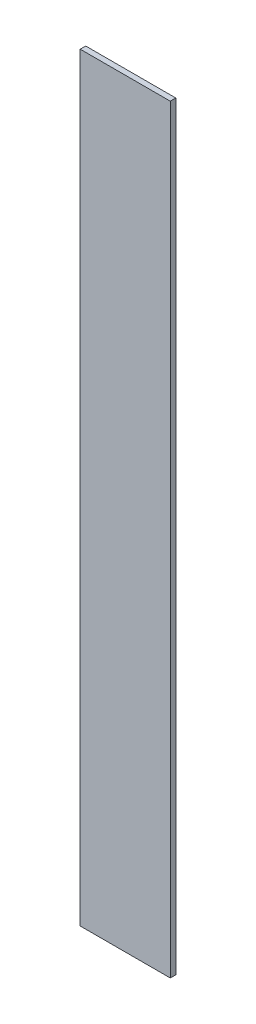
ISO-10303-21;
HEADER;
FILE_DESCRIPTION(('STEP AP214'),'2;1');
FILE_NAME('part.step','',(''),(''),'','','');
FILE_SCHEMA(('AUTOMOTIVE_DESIGN { 1 0 10303 214 1 1 1 1 }'));
ENDSEC;
DATA;
#1=APPLICATION_CONTEXT('core data for automotive mechanical design processes');
#2=APPLICATION_PROTOCOL_DEFINITION('international standard','automotive_design',2000,#1);
#3=PRODUCT_CONTEXT('',#1,'mechanical');
#4=PRODUCT('Part','Part','',(#3));
#5=PRODUCT_RELATED_PRODUCT_CATEGORY('part','',(#4));
#6=PRODUCT_DEFINITION_FORMATION('','',#4);
#7=PRODUCT_DEFINITION_CONTEXT('part definition',#1,'design');
#8=PRODUCT_DEFINITION('design','',#6,#7);
#9=PRODUCT_DEFINITION_SHAPE('','',#8);
#10=(LENGTH_UNIT() NAMED_UNIT(*) SI_UNIT(.MILLI.,.METRE.));
#11=(NAMED_UNIT(*) PLANE_ANGLE_UNIT() SI_UNIT($,.RADIAN.));
#12=(NAMED_UNIT(*) SI_UNIT($,.STERADIAN.) SOLID_ANGLE_UNIT());
#13=UNCERTAINTY_MEASURE_WITH_UNIT(LENGTH_MEASURE(1.E-05),#10,'distance_accuracy_value','');
#14=(GEOMETRIC_REPRESENTATION_CONTEXT(3) GLOBAL_UNCERTAINTY_ASSIGNED_CONTEXT((#13)) GLOBAL_UNIT_ASSIGNED_CONTEXT((#10,
#11,#12)) REPRESENTATION_CONTEXT('',''));
#15=CARTESIAN_POINT('',(0.,0.,0.));
#16=DIRECTION('',(0.,0.,1.));
#17=DIRECTION('',(1.,0.,0.));
#18=AXIS2_PLACEMENT_3D('',#15,#16,#17);
#19=CARTESIAN_POINT('',(-52.0023181319202,690.01,-55.8049663405714));
#20=DIRECTION('',(1.,0.,0.));
#21=DIRECTION('',(0.,0.,-1.));
#22=AXIS2_PLACEMENT_3D('',#19,#20,#21);
#23=PLANE('',#22);
#24=DIRECTION('',(0.,0.,1.));
#25=VECTOR('',#24,1.);
#26=CARTESIAN_POINT('',(-52.0023181319202,0.,-55.8049663405714));
#27=LINE('',#26,#25);
#28=CARTESIAN_POINT('',(-52.0023181319202,0.,-55.8049663405714));
#29=VERTEX_POINT('',#28);
#30=CARTESIAN_POINT('',(-52.0023181319202,0.,-50.8049663405714));
#31=VERTEX_POINT('',#30);
#32=EDGE_CURVE('E102',#29,#31,#27,.T.);
#33=ORIENTED_EDGE('',*,*,#32,.T.);
#34=DIRECTION('',(0.,-1.,0.));
#35=VECTOR('',#34,1.);
#36=CARTESIAN_POINT('',(-52.0023181319202,690.01,-50.8049663405714));
#37=LINE('',#36,#35);
#38=CARTESIAN_POINT('',(-52.0023181319202,690.01,-50.8049663405714));
#39=VERTEX_POINT('',#38);
#40=EDGE_CURVE('E11',#39,#31,#37,.T.);
#41=ORIENTED_EDGE('',*,*,#40,.F.);
#42=DIRECTION('',(0.,0.,1.));
#43=VECTOR('',#42,1.);
#44=CARTESIAN_POINT('',(-52.0023181319202,690.01,-55.8049663405714));
#45=LINE('',#44,#43);
#46=CARTESIAN_POINT('',(-52.0023181319202,690.01,-55.8049663405714));
#47=VERTEX_POINT('',#46);
#48=EDGE_CURVE('E90',#47,#39,#45,.T.);
#49=ORIENTED_EDGE('',*,*,#48,.F.);
#50=DIRECTION('',(0.,-1.,0.));
#51=VECTOR('',#50,1.);
#52=CARTESIAN_POINT('',(-52.0023181319202,690.01,-55.8049663405714));
#53=LINE('',#52,#51);
#54=EDGE_CURVE('E98',#47,#29,#53,.T.);
#55=ORIENTED_EDGE('',*,*,#54,.T.);
#56=EDGE_LOOP('',(#33,#41,#49,#55));
#57=FACE_BOUND('',#56,.T.);
#58=ADVANCED_FACE('F39',(#57),#23,.F.);
#59=CARTESIAN_POINT('',(-52.0023181319202,690.01,-50.8049663405714));
#60=DIRECTION('',(0.,0.,-1.));
#61=DIRECTION('',(-1.,0.,0.));
#62=AXIS2_PLACEMENT_3D('',#59,#60,#61);
#63=PLANE('',#62);
#64=DIRECTION('',(1.,0.,0.));
#65=VECTOR('',#64,1.);
#66=CARTESIAN_POINT('',(-52.0023181319202,0.,-50.8049663405714));
#67=LINE('',#66,#65);
#68=CARTESIAN_POINT('',(29.8231884600783,0.,-50.8049663405714));
#69=VERTEX_POINT('',#68);
#70=EDGE_CURVE('E94',#31,#69,#67,.T.);
#71=ORIENTED_EDGE('',*,*,#70,.T.);
#72=DIRECTION('',(0.,-1.,0.));
#73=VECTOR('',#72,1.);
#74=CARTESIAN_POINT('',(29.8231884600783,690.01,-50.8049663405714));
#75=LINE('',#74,#73);
#76=CARTESIAN_POINT('',(29.8231884600783,690.01,-50.8049663405714));
#77=VERTEX_POINT('',#76);
#78=EDGE_CURVE('E47',#77,#69,#75,.T.);
#79=ORIENTED_EDGE('',*,*,#78,.F.);
#80=DIRECTION('',(1.,0.,0.));
#81=VECTOR('',#80,1.);
#82=CARTESIAN_POINT('',(-52.0023181319202,690.01,-50.8049663405714));
#83=LINE('',#82,#81);
#84=EDGE_CURVE('E85',#39,#77,#83,.T.);
#85=ORIENTED_EDGE('',*,*,#84,.F.);
#86=ORIENTED_EDGE('',*,*,#40,.T.);
#87=EDGE_LOOP('',(#71,#79,#85,#86));
#88=FACE_BOUND('',#87,.T.);
#89=ADVANCED_FACE('F93',(#88),#63,.F.);
#90=CARTESIAN_POINT('',(29.8231884600783,690.01,-55.8049663405714));
#91=DIRECTION('',(-1.,0.,0.));
#92=DIRECTION('',(0.,0.,1.));
#93=AXIS2_PLACEMENT_3D('',#90,#91,#92);
#94=PLANE('',#93);
#95=DIRECTION('',(0.,0.,-1.));
#96=VECTOR('',#95,1.);
#97=CARTESIAN_POINT('',(29.8231884600783,0.,-55.8049663405714));
#98=LINE('',#97,#96);
#99=CARTESIAN_POINT('',(29.8231884600783,0.,-55.8049663405714));
#100=VERTEX_POINT('',#99);
#101=EDGE_CURVE('E72',#69,#100,#98,.T.);
#102=ORIENTED_EDGE('',*,*,#101,.T.);
#103=DIRECTION('',(0.,-1.,0.));
#104=VECTOR('',#103,1.);
#105=CARTESIAN_POINT('',(29.8231884600783,690.01,-55.8049663405714));
#106=LINE('',#105,#104);
#107=CARTESIAN_POINT('',(29.8231884600783,690.01,-55.8049663405714));
#108=VERTEX_POINT('',#107);
#109=EDGE_CURVE('E95',#108,#100,#106,.T.);
#110=ORIENTED_EDGE('',*,*,#109,.F.);
#111=DIRECTION('',(0.,0.,-1.));
#112=VECTOR('',#111,1.);
#113=CARTESIAN_POINT('',(29.8231884600783,690.01,-55.8049663405714));
#114=LINE('',#113,#112);
#115=EDGE_CURVE('E88',#77,#108,#114,.T.);
#116=ORIENTED_EDGE('',*,*,#115,.F.);
#117=ORIENTED_EDGE('',*,*,#78,.T.);
#118=EDGE_LOOP('',(#102,#110,#116,#117));
#119=FACE_BOUND('',#118,.T.);
#120=ADVANCED_FACE('F96',(#119),#94,.F.);
#121=CARTESIAN_POINT('',(-52.0023181319202,690.01,-55.8049663405714));
#122=DIRECTION('',(0.,0.,1.));
#123=DIRECTION('',(1.,0.,0.));
#124=AXIS2_PLACEMENT_3D('',#121,#122,#123);
#125=PLANE('',#124);
#126=DIRECTION('',(-1.,0.,0.));
#127=VECTOR('',#126,1.);
#128=CARTESIAN_POINT('',(-52.0023181319202,0.,-55.8049663405714));
#129=LINE('',#128,#127);
#130=EDGE_CURVE('E78',#100,#29,#129,.T.);
#131=ORIENTED_EDGE('',*,*,#130,.T.);
#132=ORIENTED_EDGE('',*,*,#54,.F.);
#133=DIRECTION('',(-1.,0.,0.));
#134=VECTOR('',#133,1.);
#135=CARTESIAN_POINT('',(-52.0023181319202,690.01,-55.8049663405714));
#136=LINE('',#135,#134);
#137=EDGE_CURVE('E55',#108,#47,#136,.T.);
#138=ORIENTED_EDGE('',*,*,#137,.F.);
#139=ORIENTED_EDGE('',*,*,#109,.T.);
#140=EDGE_LOOP('',(#131,#132,#138,#139));
#141=FACE_BOUND('',#140,.T.);
#142=ADVANCED_FACE('F109',(#141),#125,.F.);
#143=CARTESIAN_POINT('',(0.,690.01,0.));
#144=DIRECTION('',(0.,1.,0.));
#145=DIRECTION('',(0.,0.,1.));
#146=AXIS2_PLACEMENT_3D('',#143,#144,#145);
#147=PLANE('',#146);
#148=ORIENTED_EDGE('',*,*,#48,.T.);
#149=ORIENTED_EDGE('',*,*,#84,.T.);
#150=ORIENTED_EDGE('',*,*,#115,.T.);
#151=ORIENTED_EDGE('',*,*,#137,.T.);
#152=EDGE_LOOP('',(#148,#149,#150,#151));
#153=FACE_BOUND('',#152,.T.);
#154=ADVANCED_FACE('F86',(#153),#147,.T.);
#155=CARTESIAN_POINT('',(0.,0.,0.));
#156=DIRECTION('',(0.,1.,0.));
#157=DIRECTION('',(0.,0.,1.));
#158=AXIS2_PLACEMENT_3D('',#155,#156,#157);
#159=PLANE('',#158);
#160=ORIENTED_EDGE('',*,*,#32,.F.);
#161=ORIENTED_EDGE('',*,*,#130,.F.);
#162=ORIENTED_EDGE('',*,*,#101,.F.);
#163=ORIENTED_EDGE('',*,*,#70,.F.);
#164=EDGE_LOOP('',(#160,#161,#162,#163));
#165=FACE_BOUND('',#164,.T.);
#166=ADVANCED_FACE('F112',(#165),#159,.F.);
#167=CLOSED_SHELL('',(#58,#89,#120,#142,#154,#166));
#168=MANIFOLD_SOLID_BREP('B2',#167);
#169=ADVANCED_BREP_SHAPE_REPRESENTATION('',(#18,#168),#14);
#170=SHAPE_DEFINITION_REPRESENTATION(#9,#169);
ENDSEC;
END-ISO-10303-21;
